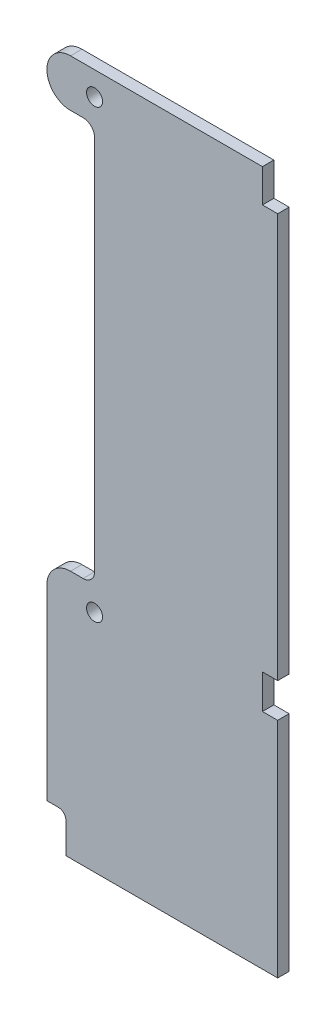
ISO-10303-21;
HEADER;
FILE_DESCRIPTION(('STEP AP214'),'2;1');
FILE_NAME('part.step','',(''),(''),'','','');
FILE_SCHEMA(('AUTOMOTIVE_DESIGN { 1 0 10303 214 1 1 1 1 }'));
ENDSEC;
DATA;
#1=APPLICATION_CONTEXT('core data for automotive mechanical design processes');
#2=APPLICATION_PROTOCOL_DEFINITION('international standard','automotive_design',2000,#1);
#3=PRODUCT_CONTEXT('',#1,'mechanical');
#4=PRODUCT('Part','Part','',(#3));
#5=PRODUCT_RELATED_PRODUCT_CATEGORY('part','',(#4));
#6=PRODUCT_DEFINITION_FORMATION('','',#4);
#7=PRODUCT_DEFINITION_CONTEXT('part definition',#1,'design');
#8=PRODUCT_DEFINITION('design','',#6,#7);
#9=PRODUCT_DEFINITION_SHAPE('','',#8);
#10=(LENGTH_UNIT() NAMED_UNIT(*) SI_UNIT(.MILLI.,.METRE.));
#11=(NAMED_UNIT(*) PLANE_ANGLE_UNIT() SI_UNIT($,.RADIAN.));
#12=(NAMED_UNIT(*) SI_UNIT($,.STERADIAN.) SOLID_ANGLE_UNIT());
#13=UNCERTAINTY_MEASURE_WITH_UNIT(LENGTH_MEASURE(1.E-05),#10,'distance_accuracy_value','');
#14=(GEOMETRIC_REPRESENTATION_CONTEXT(3) GLOBAL_UNCERTAINTY_ASSIGNED_CONTEXT((#13)) GLOBAL_UNIT_ASSIGNED_CONTEXT((#10,
#11,#12)) REPRESENTATION_CONTEXT('',''));
#15=CARTESIAN_POINT('',(0.,0.,0.));
#16=DIRECTION('',(0.,0.,1.));
#17=DIRECTION('',(1.,0.,0.));
#18=AXIS2_PLACEMENT_3D('',#15,#16,#17);
#19=CARTESIAN_POINT('',(-6.3,0.,3.));
#20=DIRECTION('',(0.,0.,1.));
#21=DIRECTION('',(1.,0.,0.));
#22=AXIS2_PLACEMENT_3D('',#19,#20,#21);
#23=PLANE('',#22);
#24=CARTESIAN_POINT('',(0.,0.,3.));
#25=DIRECTION('',(0.,0.,1.));
#26=DIRECTION('',(1.,0.,0.));
#27=AXIS2_PLACEMENT_3D('',#24,#25,#26);
#28=CIRCLE('',#27,2.1);
#29=CARTESIAN_POINT('',(2.1,0.,3.));
#30=VERTEX_POINT('',#29);
#31=EDGE_CURVE('E209',#30,#30,#28,.T.);
#32=ORIENTED_EDGE('',*,*,#31,.F.);
#33=EDGE_LOOP('',(#32));
#34=FACE_BOUND('',#33,.T.);
#35=CARTESIAN_POINT('',(-6.3,0.,3.));
#36=DIRECTION('',(0.,0.,1.));
#37=DIRECTION('',(1.,0.,0.));
#38=AXIS2_PLACEMENT_3D('',#35,#36,#37);
#39=CIRCLE('',#38,6.2);
#40=CARTESIAN_POINT('',(-6.3,6.2,3.));
#41=VERTEX_POINT('',#40);
#42=CARTESIAN_POINT('',(-12.5,0.,3.));
#43=VERTEX_POINT('',#42);
#44=EDGE_CURVE('E244',#41,#43,#39,.T.);
#45=ORIENTED_EDGE('',*,*,#44,.T.);
#46=DIRECTION('',(0.,-1.,0.));
#47=VECTOR('',#46,1.);
#48=CARTESIAN_POINT('',(-12.5,0.,3.));
#49=LINE('',#48,#47);
#50=CARTESIAN_POINT('',(-12.5,-49.,3.));
#51=VERTEX_POINT('',#50);
#52=EDGE_CURVE('E132',#43,#51,#49,.T.);
#53=ORIENTED_EDGE('',*,*,#52,.T.);
#54=DIRECTION('',(1.,0.,0.));
#55=VECTOR('',#54,1.);
#56=CARTESIAN_POINT('',(-12.5,-49.,3.));
#57=LINE('',#56,#55);
#58=CARTESIAN_POINT('',(-9.50000000000001,-49.,3.));
#59=VERTEX_POINT('',#58);
#60=EDGE_CURVE('E295',#51,#59,#57,.T.);
#61=ORIENTED_EDGE('',*,*,#60,.T.);
#62=CARTESIAN_POINT('',(-9.49999999999999,-51.,3.));
#63=DIRECTION('',(0.,0.,-1.));
#64=DIRECTION('',(1.,0.,0.));
#65=AXIS2_PLACEMENT_3D('',#62,#63,#64);
#66=CIRCLE('',#65,2.);
#67=CARTESIAN_POINT('',(-7.49999999999999,-51.,3.));
#68=VERTEX_POINT('',#67);
#69=EDGE_CURVE('E314',#59,#68,#66,.T.);
#70=ORIENTED_EDGE('',*,*,#69,.T.);
#71=DIRECTION('',(0.,-1.,0.));
#72=VECTOR('',#71,1.);
#73=CARTESIAN_POINT('',(-7.49999999999999,-51.,3.));
#74=LINE('',#73,#72);
#75=CARTESIAN_POINT('',(-7.49999999999999,-59.,3.));
#76=VERTEX_POINT('',#75);
#77=EDGE_CURVE('E311',#68,#76,#74,.T.);
#78=ORIENTED_EDGE('',*,*,#77,.T.);
#79=DIRECTION('',(1.,0.,0.));
#80=VECTOR('',#79,1.);
#81=CARTESIAN_POINT('',(-7.49999999999999,-59.,3.));
#82=LINE('',#81,#80);
#83=CARTESIAN_POINT('',(48.,-59.,3.));
#84=VERTEX_POINT('',#83);
#85=EDGE_CURVE('E313',#76,#84,#82,.T.);
#86=ORIENTED_EDGE('',*,*,#85,.T.);
#87=DIRECTION('',(0.,1.,0.));
#88=VECTOR('',#87,1.);
#89=CARTESIAN_POINT('',(48.,-0.5,3.));
#90=LINE('',#89,#88);
#91=CARTESIAN_POINT('',(48.,-0.5,3.));
#92=VERTEX_POINT('',#91);
#93=EDGE_CURVE('E316',#84,#92,#90,.T.);
#94=ORIENTED_EDGE('',*,*,#93,.T.);
#95=DIRECTION('',(-1.,0.,0.));
#96=VECTOR('',#95,1.);
#97=CARTESIAN_POINT('',(48.,-0.5,3.));
#98=LINE('',#97,#96);
#99=CARTESIAN_POINT('',(44.,-0.5,3.));
#100=VERTEX_POINT('',#99);
#101=EDGE_CURVE('E322',#92,#100,#98,.T.);
#102=ORIENTED_EDGE('',*,*,#101,.T.);
#103=DIRECTION('',(0.,1.,0.));
#104=VECTOR('',#103,1.);
#105=CARTESIAN_POINT('',(44.,-0.5,3.));
#106=LINE('',#105,#104);
#107=CARTESIAN_POINT('',(44.,8.5,3.));
#108=VERTEX_POINT('',#107);
#109=EDGE_CURVE('E324',#100,#108,#106,.T.);
#110=ORIENTED_EDGE('',*,*,#109,.T.);
#111=DIRECTION('',(1.,0.,0.));
#112=VECTOR('',#111,1.);
#113=CARTESIAN_POINT('',(44.,8.5,3.));
#114=LINE('',#113,#112);
#115=CARTESIAN_POINT('',(48.,8.5,3.));
#116=VERTEX_POINT('',#115);
#117=EDGE_CURVE('E326',#108,#116,#114,.T.);
#118=ORIENTED_EDGE('',*,*,#117,.T.);
#119=DIRECTION('',(0.,1.,0.));
#120=VECTOR('',#119,1.);
#121=CARTESIAN_POINT('',(48.,114.5,3.));
#122=LINE('',#121,#120);
#123=CARTESIAN_POINT('',(48.,114.5,3.));
#124=VERTEX_POINT('',#123);
#125=EDGE_CURVE('E328',#116,#124,#122,.T.);
#126=ORIENTED_EDGE('',*,*,#125,.T.);
#127=DIRECTION('',(-1.,0.,0.));
#128=VECTOR('',#127,1.);
#129=CARTESIAN_POINT('',(48.,114.5,3.));
#130=LINE('',#129,#128);
#131=CARTESIAN_POINT('',(44.,114.5,3.));
#132=VERTEX_POINT('',#131);
#133=EDGE_CURVE('E330',#124,#132,#130,.T.);
#134=ORIENTED_EDGE('',*,*,#133,.T.);
#135=DIRECTION('',(0.,1.,0.));
#136=VECTOR('',#135,1.);
#137=CARTESIAN_POINT('',(44.,114.5,3.));
#138=LINE('',#137,#136);
#139=CARTESIAN_POINT('',(44.,123.2,3.));
#140=VERTEX_POINT('',#139);
#141=EDGE_CURVE('E332',#132,#140,#138,.T.);
#142=ORIENTED_EDGE('',*,*,#141,.T.);
#143=DIRECTION('',(-1.,0.,0.));
#144=VECTOR('',#143,1.);
#145=CARTESIAN_POINT('',(-6.30000000000002,123.2,3.));
#146=LINE('',#145,#144);
#147=CARTESIAN_POINT('',(-6.30000000000002,123.2,3.));
#148=VERTEX_POINT('',#147);
#149=EDGE_CURVE('E334',#140,#148,#146,.T.);
#150=ORIENTED_EDGE('',*,*,#149,.T.);
#151=CARTESIAN_POINT('',(-6.30000000000002,117.,3.));
#152=DIRECTION('',(0.,0.,1.));
#153=DIRECTION('',(1.,0.,0.));
#154=AXIS2_PLACEMENT_3D('',#151,#152,#153);
#155=CIRCLE('',#154,6.2);
#156=CARTESIAN_POINT('',(-6.30000000000002,110.8,3.));
#157=VERTEX_POINT('',#156);
#158=EDGE_CURVE('E336',#148,#157,#155,.T.);
#159=ORIENTED_EDGE('',*,*,#158,.T.);
#160=DIRECTION('',(1.,0.,0.));
#161=VECTOR('',#160,1.);
#162=CARTESIAN_POINT('',(-6.30000000000002,110.8,3.));
#163=LINE('',#162,#161);
#164=CARTESIAN_POINT('',(-3.00000000000004,110.8,3.));
#165=VERTEX_POINT('',#164);
#166=EDGE_CURVE('E338',#157,#165,#163,.T.);
#167=ORIENTED_EDGE('',*,*,#166,.T.);
#168=CARTESIAN_POINT('',(-3.00000000000001,107.8,3.));
#169=DIRECTION('',(0.,0.,-1.));
#170=DIRECTION('',(1.,0.,0.));
#171=AXIS2_PLACEMENT_3D('',#168,#169,#170);
#172=CIRCLE('',#171,3.);
#173=CARTESIAN_POINT('',(0.,107.8,3.));
#174=VERTEX_POINT('',#173);
#175=EDGE_CURVE('E187',#165,#174,#172,.T.);
#176=ORIENTED_EDGE('',*,*,#175,.T.);
#177=DIRECTION('',(0.,-1.,0.));
#178=VECTOR('',#177,1.);
#179=CARTESIAN_POINT('',(0.,107.8,3.));
#180=LINE('',#179,#178);
#181=CARTESIAN_POINT('',(0.,9.20000000000002,3.));
#182=VERTEX_POINT('',#181);
#183=EDGE_CURVE('E181',#174,#182,#180,.T.);
#184=ORIENTED_EDGE('',*,*,#183,.T.);
#185=CARTESIAN_POINT('',(-3.,9.2,3.));
#186=DIRECTION('',(0.,0.,-1.));
#187=DIRECTION('',(-1.,0.,0.));
#188=AXIS2_PLACEMENT_3D('',#185,#186,#187);
#189=CIRCLE('',#188,3.);
#190=CARTESIAN_POINT('',(-3.00000000000002,6.2,3.));
#191=VERTEX_POINT('',#190);
#192=EDGE_CURVE('E185',#182,#191,#189,.T.);
#193=ORIENTED_EDGE('',*,*,#192,.T.);
#194=DIRECTION('',(-1.,0.,0.));
#195=VECTOR('',#194,1.);
#196=CARTESIAN_POINT('',(-3.00000000000002,6.2,3.));
#197=LINE('',#196,#195);
#198=EDGE_CURVE('E53',#191,#41,#197,.T.);
#199=ORIENTED_EDGE('',*,*,#198,.T.);
#200=EDGE_LOOP('',(#45,#53,#61,#70,#78,#86,#94,#102,#110,#118,#126,#134,#142,#150,#159,#167,
#176,#184,#193,#199));
#201=FACE_BOUND('',#200,.T.);
#202=CARTESIAN_POINT('',(0.,117.,3.));
#203=DIRECTION('',(0.,0.,1.));
#204=DIRECTION('',(1.,0.,0.));
#205=AXIS2_PLACEMENT_3D('',#202,#203,#204);
#206=CIRCLE('',#205,2.1);
#207=CARTESIAN_POINT('',(2.1,117.,3.));
#208=VERTEX_POINT('',#207);
#209=EDGE_CURVE('E381',#208,#208,#206,.T.);
#210=ORIENTED_EDGE('',*,*,#209,.F.);
#211=EDGE_LOOP('',(#210));
#212=FACE_BOUND('',#211,.T.);
#213=ADVANCED_FACE('F36',(#34,#201,#212),#23,.T.);
#214=CARTESIAN_POINT('',(-6.3,0.,0.));
#215=DIRECTION('',(0.,0.,1.));
#216=DIRECTION('',(1.,0.,0.));
#217=AXIS2_PLACEMENT_3D('',#214,#215,#216);
#218=PLANE('',#217);
#219=CARTESIAN_POINT('',(0.,0.,0.));
#220=DIRECTION('',(0.,0.,1.));
#221=DIRECTION('',(1.,0.,0.));
#222=AXIS2_PLACEMENT_3D('',#219,#220,#221);
#223=CIRCLE('',#222,2.1);
#224=CARTESIAN_POINT('',(2.1,0.,0.));
#225=VERTEX_POINT('',#224);
#226=EDGE_CURVE('E386',#225,#225,#223,.T.);
#227=ORIENTED_EDGE('',*,*,#226,.T.);
#228=EDGE_LOOP('',(#227));
#229=FACE_BOUND('',#228,.T.);
#230=CARTESIAN_POINT('',(-6.3,0.,0.));
#231=DIRECTION('',(0.,0.,1.));
#232=DIRECTION('',(1.,0.,0.));
#233=AXIS2_PLACEMENT_3D('',#230,#231,#232);
#234=CIRCLE('',#233,6.2);
#235=CARTESIAN_POINT('',(-6.3,6.2,0.));
#236=VERTEX_POINT('',#235);
#237=CARTESIAN_POINT('',(-12.5,0.,0.));
#238=VERTEX_POINT('',#237);
#239=EDGE_CURVE('E205',#236,#238,#234,.T.);
#240=ORIENTED_EDGE('',*,*,#239,.F.);
#241=DIRECTION('',(-1.,0.,0.));
#242=VECTOR('',#241,1.);
#243=CARTESIAN_POINT('',(-3.00000000000002,6.2,0.));
#244=LINE('',#243,#242);
#245=CARTESIAN_POINT('',(-3.00000000000002,6.2,0.));
#246=VERTEX_POINT('',#245);
#247=EDGE_CURVE('E124',#246,#236,#244,.T.);
#248=ORIENTED_EDGE('',*,*,#247,.F.);
#249=CARTESIAN_POINT('',(-3.,9.2,0.));
#250=DIRECTION('',(0.,0.,-1.));
#251=DIRECTION('',(-1.,0.,0.));
#252=AXIS2_PLACEMENT_3D('',#249,#250,#251);
#253=CIRCLE('',#252,3.);
#254=CARTESIAN_POINT('',(0.,9.20000000000002,0.));
#255=VERTEX_POINT('',#254);
#256=EDGE_CURVE('E118',#255,#246,#253,.T.);
#257=ORIENTED_EDGE('',*,*,#256,.F.);
#258=DIRECTION('',(0.,-1.,0.));
#259=VECTOR('',#258,1.);
#260=CARTESIAN_POINT('',(0.,107.8,0.));
#261=LINE('',#260,#259);
#262=CARTESIAN_POINT('',(0.,107.8,0.));
#263=VERTEX_POINT('',#262);
#264=EDGE_CURVE('E195',#263,#255,#261,.T.);
#265=ORIENTED_EDGE('',*,*,#264,.F.);
#266=CARTESIAN_POINT('',(-3.00000000000001,107.8,0.));
#267=DIRECTION('',(0.,0.,-1.));
#268=DIRECTION('',(1.,0.,0.));
#269=AXIS2_PLACEMENT_3D('',#266,#267,#268);
#270=CIRCLE('',#269,3.);
#271=CARTESIAN_POINT('',(-3.00000000000004,110.8,0.));
#272=VERTEX_POINT('',#271);
#273=EDGE_CURVE('E239',#272,#263,#270,.T.);
#274=ORIENTED_EDGE('',*,*,#273,.F.);
#275=DIRECTION('',(1.,0.,0.));
#276=VECTOR('',#275,1.);
#277=CARTESIAN_POINT('',(-6.30000000000002,110.8,0.));
#278=LINE('',#277,#276);
#279=CARTESIAN_POINT('',(-6.30000000000002,110.8,0.));
#280=VERTEX_POINT('',#279);
#281=EDGE_CURVE('E237',#280,#272,#278,.T.);
#282=ORIENTED_EDGE('',*,*,#281,.F.);
#283=CARTESIAN_POINT('',(-6.30000000000002,117.,0.));
#284=DIRECTION('',(0.,0.,1.));
#285=DIRECTION('',(1.,0.,0.));
#286=AXIS2_PLACEMENT_3D('',#283,#284,#285);
#287=CIRCLE('',#286,6.2);
#288=CARTESIAN_POINT('',(-6.30000000000002,123.2,0.));
#289=VERTEX_POINT('',#288);
#290=EDGE_CURVE('E235',#289,#280,#287,.T.);
#291=ORIENTED_EDGE('',*,*,#290,.F.);
#292=DIRECTION('',(-1.,0.,0.));
#293=VECTOR('',#292,1.);
#294=CARTESIAN_POINT('',(-6.30000000000002,123.2,0.));
#295=LINE('',#294,#293);
#296=CARTESIAN_POINT('',(44.,123.2,0.));
#297=VERTEX_POINT('',#296);
#298=EDGE_CURVE('E233',#297,#289,#295,.T.);
#299=ORIENTED_EDGE('',*,*,#298,.F.);
#300=DIRECTION('',(0.,1.,0.));
#301=VECTOR('',#300,1.);
#302=CARTESIAN_POINT('',(44.,114.5,0.));
#303=LINE('',#302,#301);
#304=CARTESIAN_POINT('',(44.,114.5,0.));
#305=VERTEX_POINT('',#304);
#306=EDGE_CURVE('E231',#305,#297,#303,.T.);
#307=ORIENTED_EDGE('',*,*,#306,.F.);
#308=DIRECTION('',(-1.,0.,0.));
#309=VECTOR('',#308,1.);
#310=CARTESIAN_POINT('',(48.,114.5,0.));
#311=LINE('',#310,#309);
#312=CARTESIAN_POINT('',(48.,114.5,0.));
#313=VERTEX_POINT('',#312);
#314=EDGE_CURVE('E229',#313,#305,#311,.T.);
#315=ORIENTED_EDGE('',*,*,#314,.F.);
#316=DIRECTION('',(0.,1.,0.));
#317=VECTOR('',#316,1.);
#318=CARTESIAN_POINT('',(48.,114.5,0.));
#319=LINE('',#318,#317);
#320=CARTESIAN_POINT('',(48.,8.5,0.));
#321=VERTEX_POINT('',#320);
#322=EDGE_CURVE('E227',#321,#313,#319,.T.);
#323=ORIENTED_EDGE('',*,*,#322,.F.);
#324=DIRECTION('',(1.,0.,0.));
#325=VECTOR('',#324,1.);
#326=CARTESIAN_POINT('',(44.,8.5,0.));
#327=LINE('',#326,#325);
#328=CARTESIAN_POINT('',(44.,8.5,0.));
#329=VERTEX_POINT('',#328);
#330=EDGE_CURVE('E225',#329,#321,#327,.T.);
#331=ORIENTED_EDGE('',*,*,#330,.F.);
#332=DIRECTION('',(0.,1.,0.));
#333=VECTOR('',#332,1.);
#334=CARTESIAN_POINT('',(44.,-0.5,0.));
#335=LINE('',#334,#333);
#336=CARTESIAN_POINT('',(44.,-0.5,0.));
#337=VERTEX_POINT('',#336);
#338=EDGE_CURVE('E223',#337,#329,#335,.T.);
#339=ORIENTED_EDGE('',*,*,#338,.F.);
#340=DIRECTION('',(-1.,0.,0.));
#341=VECTOR('',#340,1.);
#342=CARTESIAN_POINT('',(48.,-0.5,0.));
#343=LINE('',#342,#341);
#344=CARTESIAN_POINT('',(48.,-0.5,0.));
#345=VERTEX_POINT('',#344);
#346=EDGE_CURVE('E221',#345,#337,#343,.T.);
#347=ORIENTED_EDGE('',*,*,#346,.F.);
#348=DIRECTION('',(0.,1.,0.));
#349=VECTOR('',#348,1.);
#350=CARTESIAN_POINT('',(48.,-0.5,0.));
#351=LINE('',#350,#349);
#352=CARTESIAN_POINT('',(48.,-59.,0.));
#353=VERTEX_POINT('',#352);
#354=EDGE_CURVE('E219',#353,#345,#351,.T.);
#355=ORIENTED_EDGE('',*,*,#354,.F.);
#356=DIRECTION('',(1.,0.,0.));
#357=VECTOR('',#356,1.);
#358=CARTESIAN_POINT('',(-7.49999999999999,-59.,0.));
#359=LINE('',#358,#357);
#360=CARTESIAN_POINT('',(-7.49999999999999,-59.,0.));
#361=VERTEX_POINT('',#360);
#362=EDGE_CURVE('E217',#361,#353,#359,.T.);
#363=ORIENTED_EDGE('',*,*,#362,.F.);
#364=DIRECTION('',(0.,-1.,0.));
#365=VECTOR('',#364,1.);
#366=CARTESIAN_POINT('',(-7.49999999999999,-51.,0.));
#367=LINE('',#366,#365);
#368=CARTESIAN_POINT('',(-7.49999999999999,-51.,0.));
#369=VERTEX_POINT('',#368);
#370=EDGE_CURVE('E215',#369,#361,#367,.T.);
#371=ORIENTED_EDGE('',*,*,#370,.F.);
#372=CARTESIAN_POINT('',(-9.49999999999999,-51.,0.));
#373=DIRECTION('',(0.,0.,-1.));
#374=DIRECTION('',(1.,0.,0.));
#375=AXIS2_PLACEMENT_3D('',#372,#373,#374);
#376=CIRCLE('',#375,2.);
#377=CARTESIAN_POINT('',(-9.50000000000001,-49.,0.));
#378=VERTEX_POINT('',#377);
#379=EDGE_CURVE('E213',#378,#369,#376,.T.);
#380=ORIENTED_EDGE('',*,*,#379,.F.);
#381=DIRECTION('',(1.,0.,0.));
#382=VECTOR('',#381,1.);
#383=CARTESIAN_POINT('',(-12.5,-49.,0.));
#384=LINE('',#383,#382);
#385=CARTESIAN_POINT('',(-12.5,-49.,0.));
#386=VERTEX_POINT('',#385);
#387=EDGE_CURVE('E211',#386,#378,#384,.T.);
#388=ORIENTED_EDGE('',*,*,#387,.F.);
#389=DIRECTION('',(0.,-1.,0.));
#390=VECTOR('',#389,1.);
#391=CARTESIAN_POINT('',(-12.5,0.,0.));
#392=LINE('',#391,#390);
#393=EDGE_CURVE('E208',#238,#386,#392,.T.);
#394=ORIENTED_EDGE('',*,*,#393,.F.);
#395=EDGE_LOOP('',(#240,#248,#257,#265,#274,#282,#291,#299,#307,#315,#323,#331,#339,#347,#355,
#363,#371,#380,#388,#394));
#396=FACE_BOUND('',#395,.T.);
#397=CARTESIAN_POINT('',(0.,117.,0.));
#398=DIRECTION('',(0.,0.,1.));
#399=DIRECTION('',(1.,0.,0.));
#400=AXIS2_PLACEMENT_3D('',#397,#398,#399);
#401=CIRCLE('',#400,2.1);
#402=CARTESIAN_POINT('',(2.1,117.,0.));
#403=VERTEX_POINT('',#402);
#404=EDGE_CURVE('E384',#403,#403,#401,.T.);
#405=ORIENTED_EDGE('',*,*,#404,.T.);
#406=EDGE_LOOP('',(#405));
#407=FACE_BOUND('',#406,.T.);
#408=ADVANCED_FACE('F299',(#229,#396,#407),#218,.F.);
#409=CARTESIAN_POINT('',(-6.3,0.,3.));
#410=DIRECTION('',(0.,0.,-1.));
#411=DIRECTION('',(-1.,0.,0.));
#412=AXIS2_PLACEMENT_3D('',#409,#410,#411);
#413=CYLINDRICAL_SURFACE('',#412,6.2);
#414=ORIENTED_EDGE('',*,*,#239,.T.);
#415=DIRECTION('',(0.,0.,-1.));
#416=VECTOR('',#415,1.);
#417=CARTESIAN_POINT('',(-12.5,0.,3.));
#418=LINE('',#417,#416);
#419=EDGE_CURVE('E11',#43,#238,#418,.T.);
#420=ORIENTED_EDGE('',*,*,#419,.F.);
#421=ORIENTED_EDGE('',*,*,#44,.F.);
#422=DIRECTION('',(0.,0.,-1.));
#423=VECTOR('',#422,1.);
#424=CARTESIAN_POINT('',(-6.3,6.2,3.));
#425=LINE('',#424,#423);
#426=EDGE_CURVE('E201',#41,#236,#425,.T.);
#427=ORIENTED_EDGE('',*,*,#426,.T.);
#428=EDGE_LOOP('',(#414,#420,#421,#427));
#429=FACE_BOUND('',#428,.T.);
#430=ADVANCED_FACE('F38',(#429),#413,.T.);
#431=CARTESIAN_POINT('',(-12.5,0.,3.));
#432=DIRECTION('',(1.,0.,0.));
#433=DIRECTION('',(0.,1.,0.));
#434=AXIS2_PLACEMENT_3D('',#431,#432,#433);
#435=PLANE('',#434);
#436=ORIENTED_EDGE('',*,*,#393,.T.);
#437=DIRECTION('',(0.,0.,-1.));
#438=VECTOR('',#437,1.);
#439=CARTESIAN_POINT('',(-12.5,-49.,3.));
#440=LINE('',#439,#438);
#441=EDGE_CURVE('E45',#51,#386,#440,.T.);
#442=ORIENTED_EDGE('',*,*,#441,.F.);
#443=ORIENTED_EDGE('',*,*,#52,.F.);
#444=ORIENTED_EDGE('',*,*,#419,.T.);
#445=EDGE_LOOP('',(#436,#442,#443,#444));
#446=FACE_BOUND('',#445,.T.);
#447=ADVANCED_FACE('F559',(#446),#435,.F.);
#448=CARTESIAN_POINT('',(-12.5,-49.,3.));
#449=DIRECTION('',(0.,1.,0.));
#450=DIRECTION('',(0.,0.,1.));
#451=AXIS2_PLACEMENT_3D('',#448,#449,#450);
#452=PLANE('',#451);
#453=ORIENTED_EDGE('',*,*,#387,.T.);
#454=DIRECTION('',(0.,0.,-1.));
#455=VECTOR('',#454,1.);
#456=CARTESIAN_POINT('',(-9.50000000000001,-49.,3.));
#457=LINE('',#456,#455);
#458=EDGE_CURVE('E287',#59,#378,#457,.T.);
#459=ORIENTED_EDGE('',*,*,#458,.F.);
#460=ORIENTED_EDGE('',*,*,#60,.F.);
#461=ORIENTED_EDGE('',*,*,#441,.T.);
#462=EDGE_LOOP('',(#453,#459,#460,#461));
#463=FACE_BOUND('',#462,.T.);
#464=ADVANCED_FACE('F293',(#463),#452,.F.);
#465=CARTESIAN_POINT('',(-9.49999999999999,-51.,3.));
#466=DIRECTION('',(0.,0.,-1.));
#467=DIRECTION('',(-1.,0.,0.));
#468=AXIS2_PLACEMENT_3D('',#465,#466,#467);
#469=CYLINDRICAL_SURFACE('',#468,2.);
#470=ORIENTED_EDGE('',*,*,#379,.T.);
#471=DIRECTION('',(0.,0.,-1.));
#472=VECTOR('',#471,1.);
#473=CARTESIAN_POINT('',(-7.49999999999999,-51.,3.));
#474=LINE('',#473,#472);
#475=EDGE_CURVE('E284',#68,#369,#474,.T.);
#476=ORIENTED_EDGE('',*,*,#475,.F.);
#477=ORIENTED_EDGE('',*,*,#69,.F.);
#478=ORIENTED_EDGE('',*,*,#458,.T.);
#479=EDGE_LOOP('',(#470,#476,#477,#478));
#480=FACE_BOUND('',#479,.T.);
#481=ADVANCED_FACE('F305',(#480),#469,.F.);
#482=CARTESIAN_POINT('',(-7.49999999999999,-51.,3.));
#483=DIRECTION('',(1.,0.,0.));
#484=DIRECTION('',(0.,1.,0.));
#485=AXIS2_PLACEMENT_3D('',#482,#483,#484);
#486=PLANE('',#485);
#487=ORIENTED_EDGE('',*,*,#370,.T.);
#488=DIRECTION('',(0.,0.,-1.));
#489=VECTOR('',#488,1.);
#490=CARTESIAN_POINT('',(-7.49999999999999,-59.,3.));
#491=LINE('',#490,#489);
#492=EDGE_CURVE('E281',#76,#361,#491,.T.);
#493=ORIENTED_EDGE('',*,*,#492,.F.);
#494=ORIENTED_EDGE('',*,*,#77,.F.);
#495=ORIENTED_EDGE('',*,*,#475,.T.);
#496=EDGE_LOOP('',(#487,#493,#494,#495));
#497=FACE_BOUND('',#496,.T.);
#498=ADVANCED_FACE('F309',(#497),#486,.F.);
#499=CARTESIAN_POINT('',(-7.49999999999999,-59.,3.));
#500=DIRECTION('',(0.,1.,0.));
#501=DIRECTION('',(0.,0.,1.));
#502=AXIS2_PLACEMENT_3D('',#499,#500,#501);
#503=PLANE('',#502);
#504=ORIENTED_EDGE('',*,*,#362,.T.);
#505=DIRECTION('',(0.,0.,-1.));
#506=VECTOR('',#505,1.);
#507=CARTESIAN_POINT('',(48.,-59.,3.));
#508=LINE('',#507,#506);
#509=EDGE_CURVE('E278',#84,#353,#508,.T.);
#510=ORIENTED_EDGE('',*,*,#509,.F.);
#511=ORIENTED_EDGE('',*,*,#85,.F.);
#512=ORIENTED_EDGE('',*,*,#492,.T.);
#513=EDGE_LOOP('',(#504,#510,#511,#512));
#514=FACE_BOUND('',#513,.T.);
#515=ADVANCED_FACE('F524',(#514),#503,.F.);
#516=CARTESIAN_POINT('',(48.,-0.5,3.));
#517=DIRECTION('',(-1.,0.,0.));
#518=DIRECTION('',(0.,-1.,0.));
#519=AXIS2_PLACEMENT_3D('',#516,#517,#518);
#520=PLANE('',#519);
#521=ORIENTED_EDGE('',*,*,#354,.T.);
#522=DIRECTION('',(0.,0.,-1.));
#523=VECTOR('',#522,1.);
#524=CARTESIAN_POINT('',(48.,-0.5,3.));
#525=LINE('',#524,#523);
#526=EDGE_CURVE('E275',#92,#345,#525,.T.);
#527=ORIENTED_EDGE('',*,*,#526,.F.);
#528=ORIENTED_EDGE('',*,*,#93,.F.);
#529=ORIENTED_EDGE('',*,*,#509,.T.);
#530=EDGE_LOOP('',(#521,#527,#528,#529));
#531=FACE_BOUND('',#530,.T.);
#532=ADVANCED_FACE('F514',(#531),#520,.F.);
#533=CARTESIAN_POINT('',(48.,-0.5,3.));
#534=DIRECTION('',(0.,-1.,0.));
#535=DIRECTION('',(0.,0.,-1.));
#536=AXIS2_PLACEMENT_3D('',#533,#534,#535);
#537=PLANE('',#536);
#538=ORIENTED_EDGE('',*,*,#346,.T.);
#539=DIRECTION('',(0.,0.,-1.));
#540=VECTOR('',#539,1.);
#541=CARTESIAN_POINT('',(44.,-0.5,3.));
#542=LINE('',#541,#540);
#543=EDGE_CURVE('E272',#100,#337,#542,.T.);
#544=ORIENTED_EDGE('',*,*,#543,.F.);
#545=ORIENTED_EDGE('',*,*,#101,.F.);
#546=ORIENTED_EDGE('',*,*,#526,.T.);
#547=EDGE_LOOP('',(#538,#544,#545,#546));
#548=FACE_BOUND('',#547,.T.);
#549=ADVANCED_FACE('F504',(#548),#537,.F.);
#550=CARTESIAN_POINT('',(44.,-0.5,3.));
#551=DIRECTION('',(-1.,0.,0.));
#552=DIRECTION('',(0.,-1.,0.));
#553=AXIS2_PLACEMENT_3D('',#550,#551,#552);
#554=PLANE('',#553);
#555=ORIENTED_EDGE('',*,*,#338,.T.);
#556=DIRECTION('',(0.,0.,-1.));
#557=VECTOR('',#556,1.);
#558=CARTESIAN_POINT('',(44.,8.5,3.));
#559=LINE('',#558,#557);
#560=EDGE_CURVE('E269',#108,#329,#559,.T.);
#561=ORIENTED_EDGE('',*,*,#560,.F.);
#562=ORIENTED_EDGE('',*,*,#109,.F.);
#563=ORIENTED_EDGE('',*,*,#543,.T.);
#564=EDGE_LOOP('',(#555,#561,#562,#563));
#565=FACE_BOUND('',#564,.T.);
#566=ADVANCED_FACE('F494',(#565),#554,.F.);
#567=CARTESIAN_POINT('',(44.,8.5,3.));
#568=DIRECTION('',(0.,1.,0.));
#569=DIRECTION('',(0.,0.,1.));
#570=AXIS2_PLACEMENT_3D('',#567,#568,#569);
#571=PLANE('',#570);
#572=ORIENTED_EDGE('',*,*,#330,.T.);
#573=DIRECTION('',(0.,0.,-1.));
#574=VECTOR('',#573,1.);
#575=CARTESIAN_POINT('',(48.,8.5,3.));
#576=LINE('',#575,#574);
#577=EDGE_CURVE('E266',#116,#321,#576,.T.);
#578=ORIENTED_EDGE('',*,*,#577,.F.);
#579=ORIENTED_EDGE('',*,*,#117,.F.);
#580=ORIENTED_EDGE('',*,*,#560,.T.);
#581=EDGE_LOOP('',(#572,#578,#579,#580));
#582=FACE_BOUND('',#581,.T.);
#583=ADVANCED_FACE('F484',(#582),#571,.F.);
#584=CARTESIAN_POINT('',(48.,114.5,3.));
#585=DIRECTION('',(-1.,0.,0.));
#586=DIRECTION('',(0.,-1.,0.));
#587=AXIS2_PLACEMENT_3D('',#584,#585,#586);
#588=PLANE('',#587);
#589=ORIENTED_EDGE('',*,*,#322,.T.);
#590=DIRECTION('',(0.,0.,-1.));
#591=VECTOR('',#590,1.);
#592=CARTESIAN_POINT('',(48.,114.5,3.));
#593=LINE('',#592,#591);
#594=EDGE_CURVE('E263',#124,#313,#593,.T.);
#595=ORIENTED_EDGE('',*,*,#594,.F.);
#596=ORIENTED_EDGE('',*,*,#125,.F.);
#597=ORIENTED_EDGE('',*,*,#577,.T.);
#598=EDGE_LOOP('',(#589,#595,#596,#597));
#599=FACE_BOUND('',#598,.T.);
#600=ADVANCED_FACE('F474',(#599),#588,.F.);
#601=CARTESIAN_POINT('',(48.,114.5,3.));
#602=DIRECTION('',(0.,-1.,0.));
#603=DIRECTION('',(0.,0.,-1.));
#604=AXIS2_PLACEMENT_3D('',#601,#602,#603);
#605=PLANE('',#604);
#606=ORIENTED_EDGE('',*,*,#314,.T.);
#607=DIRECTION('',(0.,0.,-1.));
#608=VECTOR('',#607,1.);
#609=CARTESIAN_POINT('',(44.,114.5,3.));
#610=LINE('',#609,#608);
#611=EDGE_CURVE('E260',#132,#305,#610,.T.);
#612=ORIENTED_EDGE('',*,*,#611,.F.);
#613=ORIENTED_EDGE('',*,*,#133,.F.);
#614=ORIENTED_EDGE('',*,*,#594,.T.);
#615=EDGE_LOOP('',(#606,#612,#613,#614));
#616=FACE_BOUND('',#615,.T.);
#617=ADVANCED_FACE('F464',(#616),#605,.F.);
#618=CARTESIAN_POINT('',(44.,114.5,3.));
#619=DIRECTION('',(-1.,0.,0.));
#620=DIRECTION('',(0.,0.,1.));
#621=AXIS2_PLACEMENT_3D('',#618,#619,#620);
#622=PLANE('',#621);
#623=ORIENTED_EDGE('',*,*,#306,.T.);
#624=DIRECTION('',(0.,0.,-1.));
#625=VECTOR('',#624,1.);
#626=CARTESIAN_POINT('',(44.,123.2,3.));
#627=LINE('',#626,#625);
#628=EDGE_CURVE('E257',#140,#297,#627,.T.);
#629=ORIENTED_EDGE('',*,*,#628,.F.);
#630=ORIENTED_EDGE('',*,*,#141,.F.);
#631=ORIENTED_EDGE('',*,*,#611,.T.);
#632=EDGE_LOOP('',(#623,#629,#630,#631));
#633=FACE_BOUND('',#632,.T.);
#634=ADVANCED_FACE('F454',(#633),#622,.F.);
#635=CARTESIAN_POINT('',(-6.30000000000002,123.2,3.));
#636=DIRECTION('',(0.,-1.,0.));
#637=DIRECTION('',(0.,0.,-1.));
#638=AXIS2_PLACEMENT_3D('',#635,#636,#637);
#639=PLANE('',#638);
#640=ORIENTED_EDGE('',*,*,#298,.T.);
#641=DIRECTION('',(0.,0.,-1.));
#642=VECTOR('',#641,1.);
#643=CARTESIAN_POINT('',(-6.30000000000002,123.2,3.));
#644=LINE('',#643,#642);
#645=EDGE_CURVE('E254',#148,#289,#644,.T.);
#646=ORIENTED_EDGE('',*,*,#645,.F.);
#647=ORIENTED_EDGE('',*,*,#149,.F.);
#648=ORIENTED_EDGE('',*,*,#628,.T.);
#649=EDGE_LOOP('',(#640,#646,#647,#648));
#650=FACE_BOUND('',#649,.T.);
#651=ADVANCED_FACE('F444',(#650),#639,.F.);
#652=CARTESIAN_POINT('',(-6.30000000000002,117.,3.));
#653=DIRECTION('',(0.,0.,-1.));
#654=DIRECTION('',(-1.,0.,0.));
#655=AXIS2_PLACEMENT_3D('',#652,#653,#654);
#656=CYLINDRICAL_SURFACE('',#655,6.2);
#657=ORIENTED_EDGE('',*,*,#290,.T.);
#658=DIRECTION('',(0.,0.,-1.));
#659=VECTOR('',#658,1.);
#660=CARTESIAN_POINT('',(-6.30000000000002,110.8,3.));
#661=LINE('',#660,#659);
#662=EDGE_CURVE('E251',#157,#280,#661,.T.);
#663=ORIENTED_EDGE('',*,*,#662,.F.);
#664=ORIENTED_EDGE('',*,*,#158,.F.);
#665=ORIENTED_EDGE('',*,*,#645,.T.);
#666=EDGE_LOOP('',(#657,#663,#664,#665));
#667=FACE_BOUND('',#666,.T.);
#668=ADVANCED_FACE('F435',(#667),#656,.T.);
#669=CARTESIAN_POINT('',(-6.30000000000002,110.8,3.));
#670=DIRECTION('',(0.,1.,0.));
#671=DIRECTION('',(0.,0.,1.));
#672=AXIS2_PLACEMENT_3D('',#669,#670,#671);
#673=PLANE('',#672);
#674=ORIENTED_EDGE('',*,*,#281,.T.);
#675=DIRECTION('',(0.,0.,-1.));
#676=VECTOR('',#675,1.);
#677=CARTESIAN_POINT('',(-3.00000000000004,110.8,3.));
#678=LINE('',#677,#676);
#679=EDGE_CURVE('E248',#165,#272,#678,.T.);
#680=ORIENTED_EDGE('',*,*,#679,.F.);
#681=ORIENTED_EDGE('',*,*,#166,.F.);
#682=ORIENTED_EDGE('',*,*,#662,.T.);
#683=EDGE_LOOP('',(#674,#680,#681,#682));
#684=FACE_BOUND('',#683,.T.);
#685=ADVANCED_FACE('F344',(#684),#673,.F.);
#686=CARTESIAN_POINT('',(-3.00000000000001,107.8,3.));
#687=DIRECTION('',(0.,0.,-1.));
#688=DIRECTION('',(-1.,0.,0.));
#689=AXIS2_PLACEMENT_3D('',#686,#687,#688);
#690=CYLINDRICAL_SURFACE('',#689,3.);
#691=ORIENTED_EDGE('',*,*,#273,.T.);
#692=DIRECTION('',(0.,0.,-1.));
#693=VECTOR('',#692,1.);
#694=CARTESIAN_POINT('',(0.,107.8,3.));
#695=LINE('',#694,#693);
#696=EDGE_CURVE('E196',#174,#263,#695,.T.);
#697=ORIENTED_EDGE('',*,*,#696,.F.);
#698=ORIENTED_EDGE('',*,*,#175,.F.);
#699=ORIENTED_EDGE('',*,*,#679,.T.);
#700=EDGE_LOOP('',(#691,#697,#698,#699));
#701=FACE_BOUND('',#700,.T.);
#702=ADVANCED_FACE('F348',(#701),#690,.F.);
#703=CARTESIAN_POINT('',(0.,107.8,3.));
#704=DIRECTION('',(1.,0.,0.));
#705=DIRECTION('',(0.,1.,0.));
#706=AXIS2_PLACEMENT_3D('',#703,#704,#705);
#707=PLANE('',#706);
#708=ORIENTED_EDGE('',*,*,#264,.T.);
#709=DIRECTION('',(0.,0.,-1.));
#710=VECTOR('',#709,1.);
#711=CARTESIAN_POINT('',(0.,9.20000000000002,3.));
#712=LINE('',#711,#710);
#713=EDGE_CURVE('E192',#182,#255,#712,.T.);
#714=ORIENTED_EDGE('',*,*,#713,.F.);
#715=ORIENTED_EDGE('',*,*,#183,.F.);
#716=ORIENTED_EDGE('',*,*,#696,.T.);
#717=EDGE_LOOP('',(#708,#714,#715,#716));
#718=FACE_BOUND('',#717,.T.);
#719=ADVANCED_FACE('F193',(#718),#707,.F.);
#720=CARTESIAN_POINT('',(-3.,9.2,3.));
#721=DIRECTION('',(0.,0.,-1.));
#722=DIRECTION('',(-1.,0.,0.));
#723=AXIS2_PLACEMENT_3D('',#720,#721,#722);
#724=CYLINDRICAL_SURFACE('',#723,3.);
#725=ORIENTED_EDGE('',*,*,#256,.T.);
#726=DIRECTION('',(0.,0.,-1.));
#727=VECTOR('',#726,1.);
#728=CARTESIAN_POINT('',(-3.00000000000002,6.2,3.));
#729=LINE('',#728,#727);
#730=EDGE_CURVE('E197',#191,#246,#729,.T.);
#731=ORIENTED_EDGE('',*,*,#730,.F.);
#732=ORIENTED_EDGE('',*,*,#192,.F.);
#733=ORIENTED_EDGE('',*,*,#713,.T.);
#734=EDGE_LOOP('',(#725,#731,#732,#733));
#735=FACE_BOUND('',#734,.T.);
#736=ADVANCED_FACE('F199',(#735),#724,.F.);
#737=CARTESIAN_POINT('',(-3.00000000000002,6.2,3.));
#738=DIRECTION('',(0.,-1.,0.));
#739=DIRECTION('',(0.,0.,-1.));
#740=AXIS2_PLACEMENT_3D('',#737,#738,#739);
#741=PLANE('',#740);
#742=ORIENTED_EDGE('',*,*,#247,.T.);
#743=ORIENTED_EDGE('',*,*,#426,.F.);
#744=ORIENTED_EDGE('',*,*,#198,.F.);
#745=ORIENTED_EDGE('',*,*,#730,.T.);
#746=EDGE_LOOP('',(#742,#743,#744,#745));
#747=FACE_BOUND('',#746,.T.);
#748=ADVANCED_FACE('F352',(#747),#741,.F.);
#749=CARTESIAN_POINT('',(0.,0.,3.));
#750=DIRECTION('',(0.,0.,-1.));
#751=DIRECTION('',(-1.,0.,0.));
#752=AXIS2_PLACEMENT_3D('',#749,#750,#751);
#753=CYLINDRICAL_SURFACE('',#752,2.1);
#754=ORIENTED_EDGE('',*,*,#31,.T.);
#755=EDGE_LOOP('',(#754));
#756=FACE_BOUND('',#755,.T.);
#757=ORIENTED_EDGE('',*,*,#226,.F.);
#758=EDGE_LOOP('',(#757));
#759=FACE_BOUND('',#758,.T.);
#760=ADVANCED_FACE('F354',(#756,#759),#753,.F.);
#761=CARTESIAN_POINT('',(0.,117.,3.));
#762=DIRECTION('',(0.,0.,-1.));
#763=DIRECTION('',(-1.,0.,0.));
#764=AXIS2_PLACEMENT_3D('',#761,#762,#763);
#765=CYLINDRICAL_SURFACE('',#764,2.1);
#766=ORIENTED_EDGE('',*,*,#209,.T.);
#767=EDGE_LOOP('',(#766));
#768=FACE_BOUND('',#767,.T.);
#769=ORIENTED_EDGE('',*,*,#404,.F.);
#770=EDGE_LOOP('',(#769));
#771=FACE_BOUND('',#770,.T.);
#772=ADVANCED_FACE('F360',(#768,#771),#765,.F.);
#773=CLOSED_SHELL('',(#213,#408,#430,#447,#464,#481,#498,#515,#532,#549,#566,#583,#600,#617,
#634,#651,#668,#685,#702,#719,#736,#748,#760,#772));
#774=MANIFOLD_SOLID_BREP('B2',#773);
#775=ADVANCED_BREP_SHAPE_REPRESENTATION('',(#18,#774),#14);
#776=SHAPE_DEFINITION_REPRESENTATION(#9,#775);
ENDSEC;
END-ISO-10303-21;
